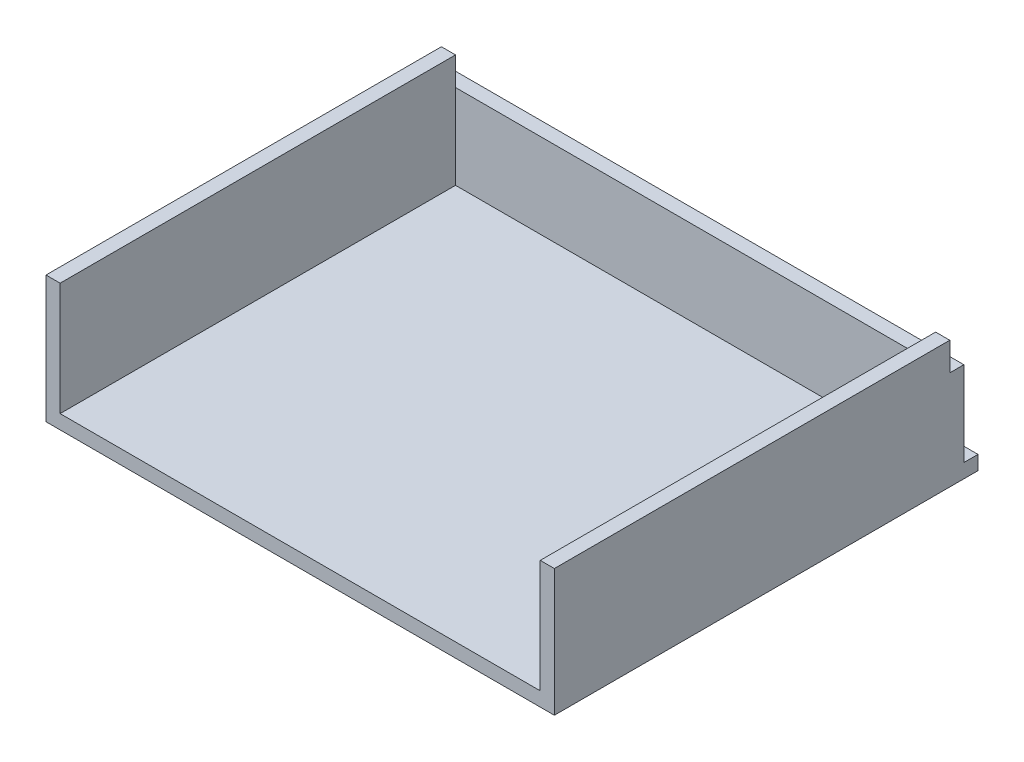
ISO-10303-21;
HEADER;
FILE_DESCRIPTION(('STEP AP214'),'2;1');
FILE_NAME('part.step','',(''),(''),'','','');
FILE_SCHEMA(('AUTOMOTIVE_DESIGN { 1 0 10303 214 1 1 1 1 }'));
ENDSEC;
DATA;
#1=APPLICATION_CONTEXT('core data for automotive mechanical design processes');
#2=APPLICATION_PROTOCOL_DEFINITION('international standard','automotive_design',2000,#1);
#3=PRODUCT_CONTEXT('',#1,'mechanical');
#4=PRODUCT('Part','Part','',(#3));
#5=PRODUCT_RELATED_PRODUCT_CATEGORY('part','',(#4));
#6=PRODUCT_DEFINITION_FORMATION('','',#4);
#7=PRODUCT_DEFINITION_CONTEXT('part definition',#1,'design');
#8=PRODUCT_DEFINITION('design','',#6,#7);
#9=PRODUCT_DEFINITION_SHAPE('','',#8);
#10=(LENGTH_UNIT() NAMED_UNIT(*) SI_UNIT(.MILLI.,.METRE.));
#11=(NAMED_UNIT(*) PLANE_ANGLE_UNIT() SI_UNIT($,.RADIAN.));
#12=(NAMED_UNIT(*) SI_UNIT($,.STERADIAN.) SOLID_ANGLE_UNIT());
#13=UNCERTAINTY_MEASURE_WITH_UNIT(LENGTH_MEASURE(1.E-05),#10,'distance_accuracy_value','');
#14=(GEOMETRIC_REPRESENTATION_CONTEXT(3) GLOBAL_UNCERTAINTY_ASSIGNED_CONTEXT((#13)) GLOBAL_UNIT_ASSIGNED_CONTEXT((#10,
#11,#12)) REPRESENTATION_CONTEXT('',''));
#15=CARTESIAN_POINT('',(0.,0.,0.));
#16=DIRECTION('',(0.,0.,1.));
#17=DIRECTION('',(1.,0.,0.));
#18=AXIS2_PLACEMENT_3D('',#15,#16,#17);
#19=CARTESIAN_POINT('',(0.,5.,0.));
#20=DIRECTION('',(0.,1.,0.));
#21=DIRECTION('',(0.,0.,1.));
#22=AXIS2_PLACEMENT_3D('',#19,#20,#21);
#23=PLANE('',#22);
#24=DIRECTION('',(1.,0.,0.));
#25=VECTOR('',#24,1.);
#26=CARTESIAN_POINT('',(-80.6051437216339,5.,-40.2420574886536));
#27=LINE('',#26,#25);
#28=CARTESIAN_POINT('',(-75.6051437216339,5.,-40.2420574886536));
#29=VERTEX_POINT('',#28);
#30=CARTESIAN_POINT('',(94.394856278366,5.,-40.2420574886536));
#31=VERTEX_POINT('',#30);
#32=EDGE_CURVE('E145',#29,#31,#27,.T.);
#33=ORIENTED_EDGE('',*,*,#32,.F.);
#34=DIRECTION('',(0.,0.,1.));
#35=VECTOR('',#34,1.);
#36=CARTESIAN_POINT('',(-75.6051437216339,5.,-40.2420574886536));
#37=LINE('',#36,#35);
#38=CARTESIAN_POINT('',(-75.6051437216339,5.,99.7579425113464));
#39=VERTEX_POINT('',#38);
#40=EDGE_CURVE('E165',#29,#39,#37,.T.);
#41=ORIENTED_EDGE('',*,*,#40,.T.);
#42=DIRECTION('',(1.,0.,0.));
#43=VECTOR('',#42,1.);
#44=CARTESIAN_POINT('',(-80.6051437216339,5.,99.7579425113464));
#45=LINE('',#44,#43);
#46=CARTESIAN_POINT('',(94.394856278366,5.,99.7579425113464));
#47=VERTEX_POINT('',#46);
#48=EDGE_CURVE('E60',#39,#47,#45,.T.);
#49=ORIENTED_EDGE('',*,*,#48,.T.);
#50=DIRECTION('',(0.,0.,1.));
#51=VECTOR('',#50,1.);
#52=CARTESIAN_POINT('',(94.3948562783661,5.,-40.2420574886536));
#53=LINE('',#52,#51);
#54=EDGE_CURVE('E280',#31,#47,#53,.T.);
#55=ORIENTED_EDGE('',*,*,#54,.F.);
#56=EDGE_LOOP('',(#33,#41,#49,#55));
#57=FACE_BOUND('',#56,.T.);
#58=ADVANCED_FACE('F37',(#57),#23,.T.);
#59=DIRECTION('',(1.,0.,0.));
#60=VECTOR('',#59,1.);
#61=CARTESIAN_POINT('',(-80.6051437216339,5.,-45.2420574886536));
#62=LINE('',#61,#60);
#63=CARTESIAN_POINT('',(-80.6051437216339,5.,-45.2420574886536));
#64=VERTEX_POINT('',#63);
#65=CARTESIAN_POINT('',(99.3948562783661,5.,-45.2420574886536));
#66=VERTEX_POINT('',#65);
#67=EDGE_CURVE('E135',#64,#66,#62,.T.);
#68=ORIENTED_EDGE('',*,*,#67,.T.);
#69=DIRECTION('',(0.,0.,-1.));
#70=VECTOR('',#69,1.);
#71=CARTESIAN_POINT('',(99.3948562783661,5.,-50.2420574886536));
#72=LINE('',#71,#70);
#73=CARTESIAN_POINT('',(99.3948562783661,5.,-50.2420574886536));
#74=VERTEX_POINT('',#73);
#75=EDGE_CURVE('E160',#66,#74,#72,.T.);
#76=ORIENTED_EDGE('',*,*,#75,.T.);
#77=DIRECTION('',(-1.,0.,0.));
#78=VECTOR('',#77,1.);
#79=CARTESIAN_POINT('',(-80.6051437216339,5.,-50.2420574886536));
#80=LINE('',#79,#78);
#81=CARTESIAN_POINT('',(-80.6051437216339,5.,-50.2420574886536));
#82=VERTEX_POINT('',#81);
#83=EDGE_CURVE('E156',#74,#82,#80,.T.);
#84=ORIENTED_EDGE('',*,*,#83,.T.);
#85=DIRECTION('',(0.,0.,1.));
#86=VECTOR('',#85,1.);
#87=CARTESIAN_POINT('',(-80.6051437216339,5.,-50.2420574886536));
#88=LINE('',#87,#86);
#89=EDGE_CURVE('E150',#82,#64,#88,.T.);
#90=ORIENTED_EDGE('',*,*,#89,.T.);
#91=EDGE_LOOP('',(#68,#76,#84,#90));
#92=FACE_BOUND('',#91,.T.);
#93=ADVANCED_FACE('F154',(#92),#23,.T.);
#94=CARTESIAN_POINT('',(-80.6051437216339,5.,-50.2420574886536));
#95=DIRECTION('',(1.,0.,0.));
#96=DIRECTION('',(0.,0.,-1.));
#97=AXIS2_PLACEMENT_3D('',#94,#95,#96);
#98=PLANE('',#97);
#99=DIRECTION('',(0.,1.,0.));
#100=VECTOR('',#99,1.);
#101=CARTESIAN_POINT('',(-80.6051437216339,5.,-45.2420574886536));
#102=LINE('',#101,#100);
#103=CARTESIAN_POINT('',(-80.6051437216339,35.,-45.2420574886536));
#104=VERTEX_POINT('',#103);
#105=EDGE_CURVE('E138',#64,#104,#102,.T.);
#106=ORIENTED_EDGE('',*,*,#105,.F.);
#107=ORIENTED_EDGE('',*,*,#89,.F.);
#108=DIRECTION('',(0.,-1.,0.));
#109=VECTOR('',#108,1.);
#110=CARTESIAN_POINT('',(-80.6051437216339,5.,-50.2420574886536));
#111=LINE('',#110,#109);
#112=CARTESIAN_POINT('',(-80.6051437216339,0.,-50.2420574886536));
#113=VERTEX_POINT('',#112);
#114=EDGE_CURVE('E170',#82,#113,#111,.T.);
#115=ORIENTED_EDGE('',*,*,#114,.T.);
#116=DIRECTION('',(0.,0.,1.));
#117=VECTOR('',#116,1.);
#118=CARTESIAN_POINT('',(-80.6051437216339,0.,-50.2420574886536));
#119=LINE('',#118,#117);
#120=CARTESIAN_POINT('',(-80.6051437216339,0.,99.7579425113464));
#121=VERTEX_POINT('',#120);
#122=EDGE_CURVE('E171',#113,#121,#119,.T.);
#123=ORIENTED_EDGE('',*,*,#122,.T.);
#124=DIRECTION('',(0.,-1.,0.));
#125=VECTOR('',#124,1.);
#126=CARTESIAN_POINT('',(-80.6051437216339,5.,99.7579425113464));
#127=LINE('',#126,#125);
#128=CARTESIAN_POINT('',(-80.6051437216339,45.,99.7579425113464));
#129=VERTEX_POINT('',#128);
#130=EDGE_CURVE('E45',#129,#121,#127,.T.);
#131=ORIENTED_EDGE('',*,*,#130,.F.);
#132=DIRECTION('',(0.,0.,1.));
#133=VECTOR('',#132,1.);
#134=CARTESIAN_POINT('',(-80.6051437216339,45.,-40.2420574886536));
#135=LINE('',#134,#133);
#136=CARTESIAN_POINT('',(-80.6051437216339,45.,-40.2420574886536));
#137=VERTEX_POINT('',#136);
#138=EDGE_CURVE('E175',#137,#129,#135,.T.);
#139=ORIENTED_EDGE('',*,*,#138,.F.);
#140=DIRECTION('',(0.,-1.,0.));
#141=VECTOR('',#140,1.);
#142=CARTESIAN_POINT('',(-80.6051437216339,5.,-40.2420574886536));
#143=LINE('',#142,#141);
#144=CARTESIAN_POINT('',(-80.6051437216339,35.,-40.2420574886536));
#145=VERTEX_POINT('',#144);
#146=EDGE_CURVE('E286',#137,#145,#143,.T.);
#147=ORIENTED_EDGE('',*,*,#146,.T.);
#148=DIRECTION('',(0.,0.,1.));
#149=VECTOR('',#148,1.);
#150=CARTESIAN_POINT('',(-80.6051437216339,35.,-40.2420574886536));
#151=LINE('',#150,#149);
#152=EDGE_CURVE('E152',#104,#145,#151,.T.);
#153=ORIENTED_EDGE('',*,*,#152,.F.);
#154=EDGE_LOOP('',(#106,#107,#115,#123,#131,#139,#147,#153));
#155=FACE_BOUND('',#154,.T.);
#156=ADVANCED_FACE('F39',(#155),#98,.F.);
#157=CARTESIAN_POINT('',(-80.6051437216339,5.,99.7579425113464));
#158=DIRECTION('',(0.,0.,-1.));
#159=DIRECTION('',(-1.,0.,0.));
#160=AXIS2_PLACEMENT_3D('',#157,#158,#159);
#161=PLANE('',#160);
#162=DIRECTION('',(1.,0.,0.));
#163=VECTOR('',#162,1.);
#164=CARTESIAN_POINT('',(-80.6051437216339,0.,99.7579425113464));
#165=LINE('',#164,#163);
#166=CARTESIAN_POINT('',(99.3948562783661,0.,99.7579425113464));
#167=VERTEX_POINT('',#166);
#168=EDGE_CURVE('E174',#121,#167,#165,.T.);
#169=ORIENTED_EDGE('',*,*,#168,.T.);
#170=DIRECTION('',(0.,-1.,0.));
#171=VECTOR('',#170,1.);
#172=CARTESIAN_POINT('',(99.3948562783661,5.,99.7579425113464));
#173=LINE('',#172,#171);
#174=CARTESIAN_POINT('',(99.3948562783661,45.,99.7579425113464));
#175=VERTEX_POINT('',#174);
#176=EDGE_CURVE('E182',#175,#167,#173,.T.);
#177=ORIENTED_EDGE('',*,*,#176,.F.);
#178=DIRECTION('',(-1.,0.,0.));
#179=VECTOR('',#178,1.);
#180=CARTESIAN_POINT('',(99.3948562783661,45.,99.7579425113464));
#181=LINE('',#180,#179);
#182=CARTESIAN_POINT('',(94.3948562783661,45.,99.7579425113464));
#183=VERTEX_POINT('',#182);
#184=EDGE_CURVE('E261',#175,#183,#181,.T.);
#185=ORIENTED_EDGE('',*,*,#184,.T.);
#186=DIRECTION('',(0.,-1.,0.));
#187=VECTOR('',#186,1.);
#188=CARTESIAN_POINT('',(94.3948562783661,5.,99.7579425113464));
#189=LINE('',#188,#187);
#190=EDGE_CURVE('E268',#183,#47,#189,.T.);
#191=ORIENTED_EDGE('',*,*,#190,.T.);
#192=ORIENTED_EDGE('',*,*,#48,.F.);
#193=DIRECTION('',(0.,1.,0.));
#194=VECTOR('',#193,1.);
#195=CARTESIAN_POINT('',(-75.6051437216339,5.,99.7579425113464));
#196=LINE('',#195,#194);
#197=CARTESIAN_POINT('',(-75.6051437216339,45.,99.7579425113464));
#198=VERTEX_POINT('',#197);
#199=EDGE_CURVE('E282',#39,#198,#196,.T.);
#200=ORIENTED_EDGE('',*,*,#199,.T.);
#201=DIRECTION('',(-1.,0.,0.));
#202=VECTOR('',#201,1.);
#203=CARTESIAN_POINT('',(-80.6051437216339,45.,99.7579425113464));
#204=LINE('',#203,#202);
#205=EDGE_CURVE('E190',#198,#129,#204,.T.);
#206=ORIENTED_EDGE('',*,*,#205,.T.);
#207=ORIENTED_EDGE('',*,*,#130,.T.);
#208=EDGE_LOOP('',(#169,#177,#185,#191,#192,#200,#206,#207));
#209=FACE_BOUND('',#208,.T.);
#210=ADVANCED_FACE('F187',(#209),#161,.F.);
#211=CARTESIAN_POINT('',(99.3948562783661,5.,-50.2420574886536));
#212=DIRECTION('',(-1.,0.,0.));
#213=DIRECTION('',(0.,0.,1.));
#214=AXIS2_PLACEMENT_3D('',#211,#212,#213);
#215=PLANE('',#214);
#216=ORIENTED_EDGE('',*,*,#75,.F.);
#217=DIRECTION('',(0.,1.,0.));
#218=VECTOR('',#217,1.);
#219=CARTESIAN_POINT('',(99.3948562783661,5.,-45.2420574886536));
#220=LINE('',#219,#218);
#221=CARTESIAN_POINT('',(99.3948562783661,35.,-45.2420574886536));
#222=VERTEX_POINT('',#221);
#223=EDGE_CURVE('E140',#66,#222,#220,.T.);
#224=ORIENTED_EDGE('',*,*,#223,.T.);
#225=DIRECTION('',(0.,0.,1.));
#226=VECTOR('',#225,1.);
#227=CARTESIAN_POINT('',(99.3948562783661,35.,-40.2420574886536));
#228=LINE('',#227,#226);
#229=CARTESIAN_POINT('',(99.3948562783661,35.,-40.2420574886536));
#230=VERTEX_POINT('',#229);
#231=EDGE_CURVE('E52',#222,#230,#228,.T.);
#232=ORIENTED_EDGE('',*,*,#231,.T.);
#233=DIRECTION('',(0.,1.,0.));
#234=VECTOR('',#233,1.);
#235=CARTESIAN_POINT('',(99.3948562783661,5.,-40.2420574886536));
#236=LINE('',#235,#234);
#237=CARTESIAN_POINT('',(99.3948562783661,45.,-40.2420574886536));
#238=VERTEX_POINT('',#237);
#239=EDGE_CURVE('E265',#230,#238,#236,.T.);
#240=ORIENTED_EDGE('',*,*,#239,.T.);
#241=DIRECTION('',(0.,0.,1.));
#242=VECTOR('',#241,1.);
#243=CARTESIAN_POINT('',(99.3948562783661,45.,-40.2420574886536));
#244=LINE('',#243,#242);
#245=EDGE_CURVE('E275',#238,#175,#244,.T.);
#246=ORIENTED_EDGE('',*,*,#245,.T.);
#247=ORIENTED_EDGE('',*,*,#176,.T.);
#248=DIRECTION('',(0.,0.,-1.));
#249=VECTOR('',#248,1.);
#250=CARTESIAN_POINT('',(99.3948562783661,0.,-50.2420574886536));
#251=LINE('',#250,#249);
#252=CARTESIAN_POINT('',(99.3948562783661,0.,-50.2420574886536));
#253=VERTEX_POINT('',#252);
#254=EDGE_CURVE('E162',#167,#253,#251,.T.);
#255=ORIENTED_EDGE('',*,*,#254,.T.);
#256=DIRECTION('',(0.,-1.,0.));
#257=VECTOR('',#256,1.);
#258=CARTESIAN_POINT('',(99.3948562783661,5.,-50.2420574886536));
#259=LINE('',#258,#257);
#260=EDGE_CURVE('E179',#74,#253,#259,.T.);
#261=ORIENTED_EDGE('',*,*,#260,.F.);
#262=EDGE_LOOP('',(#216,#224,#232,#240,#246,#247,#255,#261));
#263=FACE_BOUND('',#262,.T.);
#264=ADVANCED_FACE('F198',(#263),#215,.F.);
#265=CARTESIAN_POINT('',(-80.6051437216339,5.,-50.2420574886536));
#266=DIRECTION('',(0.,0.,1.));
#267=DIRECTION('',(1.,0.,0.));
#268=AXIS2_PLACEMENT_3D('',#265,#266,#267);
#269=PLANE('',#268);
#270=DIRECTION('',(-1.,0.,0.));
#271=VECTOR('',#270,1.);
#272=CARTESIAN_POINT('',(-80.6051437216339,0.,-50.2420574886536));
#273=LINE('',#272,#271);
#274=EDGE_CURVE('E158',#253,#113,#273,.T.);
#275=ORIENTED_EDGE('',*,*,#274,.T.);
#276=ORIENTED_EDGE('',*,*,#114,.F.);
#277=ORIENTED_EDGE('',*,*,#83,.F.);
#278=ORIENTED_EDGE('',*,*,#260,.T.);
#279=EDGE_LOOP('',(#275,#276,#277,#278));
#280=FACE_BOUND('',#279,.T.);
#281=ADVANCED_FACE('F201',(#280),#269,.F.);
#282=CARTESIAN_POINT('',(0.,0.,0.));
#283=DIRECTION('',(0.,1.,0.));
#284=DIRECTION('',(0.,0.,1.));
#285=AXIS2_PLACEMENT_3D('',#282,#283,#284);
#286=PLANE('',#285);
#287=ORIENTED_EDGE('',*,*,#122,.F.);
#288=ORIENTED_EDGE('',*,*,#274,.F.);
#289=ORIENTED_EDGE('',*,*,#254,.F.);
#290=ORIENTED_EDGE('',*,*,#168,.F.);
#291=EDGE_LOOP('',(#287,#288,#289,#290));
#292=FACE_BOUND('',#291,.T.);
#293=ADVANCED_FACE('F195',(#292),#286,.F.);
#294=CARTESIAN_POINT('',(-80.6051437216339,45.,-40.2420574886536));
#295=DIRECTION('',(0.,1.,0.));
#296=DIRECTION('',(0.,0.,1.));
#297=AXIS2_PLACEMENT_3D('',#294,#295,#296);
#298=PLANE('',#297);
#299=ORIENTED_EDGE('',*,*,#205,.F.);
#300=DIRECTION('',(0.,0.,1.));
#301=VECTOR('',#300,1.);
#302=CARTESIAN_POINT('',(-75.6051437216339,45.,-40.2420574886536));
#303=LINE('',#302,#301);
#304=CARTESIAN_POINT('',(-75.6051437216339,45.,-40.2420574886536));
#305=VERTEX_POINT('',#304);
#306=EDGE_CURVE('E297',#305,#198,#303,.T.);
#307=ORIENTED_EDGE('',*,*,#306,.F.);
#308=DIRECTION('',(-1.,0.,0.));
#309=VECTOR('',#308,1.);
#310=CARTESIAN_POINT('',(-80.6051437216339,45.,-40.2420574886536));
#311=LINE('',#310,#309);
#312=EDGE_CURVE('E292',#305,#137,#311,.T.);
#313=ORIENTED_EDGE('',*,*,#312,.T.);
#314=ORIENTED_EDGE('',*,*,#138,.T.);
#315=EDGE_LOOP('',(#299,#307,#313,#314));
#316=FACE_BOUND('',#315,.T.);
#317=ADVANCED_FACE('F208',(#316),#298,.T.);
#318=CARTESIAN_POINT('',(-75.6051437216339,5.,-40.2420574886536));
#319=DIRECTION('',(1.,0.,0.));
#320=DIRECTION('',(0.,0.,-1.));
#321=AXIS2_PLACEMENT_3D('',#318,#319,#320);
#322=PLANE('',#321);
#323=ORIENTED_EDGE('',*,*,#199,.F.);
#324=ORIENTED_EDGE('',*,*,#40,.F.);
#325=DIRECTION('',(0.,1.,0.));
#326=VECTOR('',#325,1.);
#327=CARTESIAN_POINT('',(-75.6051437216339,5.,-40.2420574886536));
#328=LINE('',#327,#326);
#329=CARTESIAN_POINT('',(-75.6051437216339,35.,-40.2420574886536));
#330=VERTEX_POINT('',#329);
#331=EDGE_CURVE('E289',#29,#330,#328,.T.);
#332=ORIENTED_EDGE('',*,*,#331,.T.);
#333=EDGE_CURVE('E288',#330,#305,#328,.T.);
#334=ORIENTED_EDGE('',*,*,#333,.T.);
#335=ORIENTED_EDGE('',*,*,#306,.T.);
#336=EDGE_LOOP('',(#323,#324,#332,#334,#335));
#337=FACE_BOUND('',#336,.T.);
#338=ADVANCED_FACE('F218',(#337),#322,.T.);
#339=CARTESIAN_POINT('',(0.,0.,-40.2420574886536));
#340=DIRECTION('',(0.,0.,-1.));
#341=DIRECTION('',(-1.,0.,0.));
#342=AXIS2_PLACEMENT_3D('',#339,#340,#341);
#343=PLANE('',#342);
#344=DIRECTION('',(1.,0.,0.));
#345=VECTOR('',#344,1.);
#346=CARTESIAN_POINT('',(-80.6051437216339,35.,-40.2420574886536));
#347=LINE('',#346,#345);
#348=EDGE_CURVE('E258',#145,#330,#347,.T.);
#349=ORIENTED_EDGE('',*,*,#348,.F.);
#350=ORIENTED_EDGE('',*,*,#146,.F.);
#351=ORIENTED_EDGE('',*,*,#312,.F.);
#352=ORIENTED_EDGE('',*,*,#333,.F.);
#353=EDGE_LOOP('',(#349,#350,#351,#352));
#354=FACE_BOUND('',#353,.T.);
#355=ADVANCED_FACE('F221',(#354),#343,.T.);
#356=CARTESIAN_POINT('',(94.3948562783661,5.,-40.2420574886536));
#357=DIRECTION('',(-1.,0.,0.));
#358=DIRECTION('',(0.,0.,1.));
#359=AXIS2_PLACEMENT_3D('',#356,#357,#358);
#360=PLANE('',#359);
#361=ORIENTED_EDGE('',*,*,#190,.F.);
#362=DIRECTION('',(0.,0.,1.));
#363=VECTOR('',#362,1.);
#364=CARTESIAN_POINT('',(94.3948562783661,45.,-40.2420574886536));
#365=LINE('',#364,#363);
#366=CARTESIAN_POINT('',(94.3948562783661,45.,-40.2420574886536));
#367=VERTEX_POINT('',#366);
#368=EDGE_CURVE('E283',#367,#183,#365,.T.);
#369=ORIENTED_EDGE('',*,*,#368,.F.);
#370=DIRECTION('',(0.,-1.,0.));
#371=VECTOR('',#370,1.);
#372=CARTESIAN_POINT('',(94.3948562783661,5.,-40.2420574886536));
#373=LINE('',#372,#371);
#374=CARTESIAN_POINT('',(94.394856278366,35.,-40.2420574886536));
#375=VERTEX_POINT('',#374);
#376=EDGE_CURVE('E272',#367,#375,#373,.T.);
#377=ORIENTED_EDGE('',*,*,#376,.T.);
#378=EDGE_CURVE('E271',#375,#31,#373,.T.);
#379=ORIENTED_EDGE('',*,*,#378,.T.);
#380=ORIENTED_EDGE('',*,*,#54,.T.);
#381=EDGE_LOOP('',(#361,#369,#377,#379,#380));
#382=FACE_BOUND('',#381,.T.);
#383=ADVANCED_FACE('F228',(#382),#360,.T.);
#384=CARTESIAN_POINT('',(99.3948562783661,45.,-40.2420574886536));
#385=DIRECTION('',(0.,1.,0.));
#386=DIRECTION('',(0.,0.,1.));
#387=AXIS2_PLACEMENT_3D('',#384,#385,#386);
#388=PLANE('',#387);
#389=ORIENTED_EDGE('',*,*,#184,.F.);
#390=ORIENTED_EDGE('',*,*,#245,.F.);
#391=DIRECTION('',(-1.,0.,0.));
#392=VECTOR('',#391,1.);
#393=CARTESIAN_POINT('',(99.3948562783661,45.,-40.2420574886536));
#394=LINE('',#393,#392);
#395=EDGE_CURVE('E267',#238,#367,#394,.T.);
#396=ORIENTED_EDGE('',*,*,#395,.T.);
#397=ORIENTED_EDGE('',*,*,#368,.T.);
#398=EDGE_LOOP('',(#389,#390,#396,#397));
#399=FACE_BOUND('',#398,.T.);
#400=ADVANCED_FACE('F230',(#399),#388,.T.);
#401=CARTESIAN_POINT('',(0.,0.,-40.2420574886536));
#402=DIRECTION('',(0.,0.,1.));
#403=DIRECTION('',(1.,0.,0.));
#404=AXIS2_PLACEMENT_3D('',#401,#402,#403);
#405=PLANE('',#404);
#406=ORIENTED_EDGE('',*,*,#239,.F.);
#407=DIRECTION('',(-1.,0.,0.));
#408=VECTOR('',#407,1.);
#409=CARTESIAN_POINT('',(0.,35.,-40.2420574886536));
#410=LINE('',#409,#408);
#411=EDGE_CURVE('E11',#230,#375,#410,.T.);
#412=ORIENTED_EDGE('',*,*,#411,.T.);
#413=ORIENTED_EDGE('',*,*,#376,.F.);
#414=ORIENTED_EDGE('',*,*,#395,.F.);
#415=EDGE_LOOP('',(#406,#412,#413,#414));
#416=FACE_BOUND('',#415,.T.);
#417=ADVANCED_FACE('F233',(#416),#405,.F.);
#418=CARTESIAN_POINT('',(-80.6051437216339,5.,-40.2420574886536));
#419=DIRECTION('',(0.,0.,1.));
#420=DIRECTION('',(1.,0.,0.));
#421=AXIS2_PLACEMENT_3D('',#418,#419,#420);
#422=PLANE('',#421);
#423=EDGE_CURVE('E262',#330,#375,#347,.T.);
#424=ORIENTED_EDGE('',*,*,#423,.F.);
#425=ORIENTED_EDGE('',*,*,#331,.F.);
#426=ORIENTED_EDGE('',*,*,#32,.T.);
#427=ORIENTED_EDGE('',*,*,#378,.F.);
#428=EDGE_LOOP('',(#424,#425,#426,#427));
#429=FACE_BOUND('',#428,.T.);
#430=ADVANCED_FACE('F240',(#429),#422,.T.);
#431=CARTESIAN_POINT('',(-80.6051437216339,35.,-40.2420574886536));
#432=DIRECTION('',(0.,1.,0.));
#433=DIRECTION('',(0.,0.,1.));
#434=AXIS2_PLACEMENT_3D('',#431,#432,#433);
#435=PLANE('',#434);
#436=ORIENTED_EDGE('',*,*,#231,.F.);
#437=DIRECTION('',(1.,0.,0.));
#438=VECTOR('',#437,1.);
#439=CARTESIAN_POINT('',(-80.6051437216339,35.,-45.2420574886536));
#440=LINE('',#439,#438);
#441=EDGE_CURVE('E144',#104,#222,#440,.T.);
#442=ORIENTED_EDGE('',*,*,#441,.F.);
#443=ORIENTED_EDGE('',*,*,#152,.T.);
#444=ORIENTED_EDGE('',*,*,#348,.T.);
#445=ORIENTED_EDGE('',*,*,#423,.T.);
#446=ORIENTED_EDGE('',*,*,#411,.F.);
#447=EDGE_LOOP('',(#436,#442,#443,#444,#445,#446));
#448=FACE_BOUND('',#447,.T.);
#449=ADVANCED_FACE('F244',(#448),#435,.T.);
#450=CARTESIAN_POINT('',(-80.6051437216339,5.,-45.2420574886536));
#451=DIRECTION('',(0.,0.,-1.));
#452=DIRECTION('',(-1.,0.,0.));
#453=AXIS2_PLACEMENT_3D('',#450,#451,#452);
#454=PLANE('',#453);
#455=ORIENTED_EDGE('',*,*,#223,.F.);
#456=ORIENTED_EDGE('',*,*,#67,.F.);
#457=ORIENTED_EDGE('',*,*,#105,.T.);
#458=ORIENTED_EDGE('',*,*,#441,.T.);
#459=EDGE_LOOP('',(#455,#456,#457,#458));
#460=FACE_BOUND('',#459,.T.);
#461=ADVANCED_FACE('F137',(#460),#454,.T.);
#462=CLOSED_SHELL('',(#58,#93,#156,#210,#264,#281,#293,#317,#338,#355,#383,#400,#417,#430,#449,#461));
#463=MANIFOLD_SOLID_BREP('B2',#462);
#464=ADVANCED_BREP_SHAPE_REPRESENTATION('',(#18,#463),#14);
#465=SHAPE_DEFINITION_REPRESENTATION(#9,#464);
ENDSEC;
END-ISO-10303-21;
